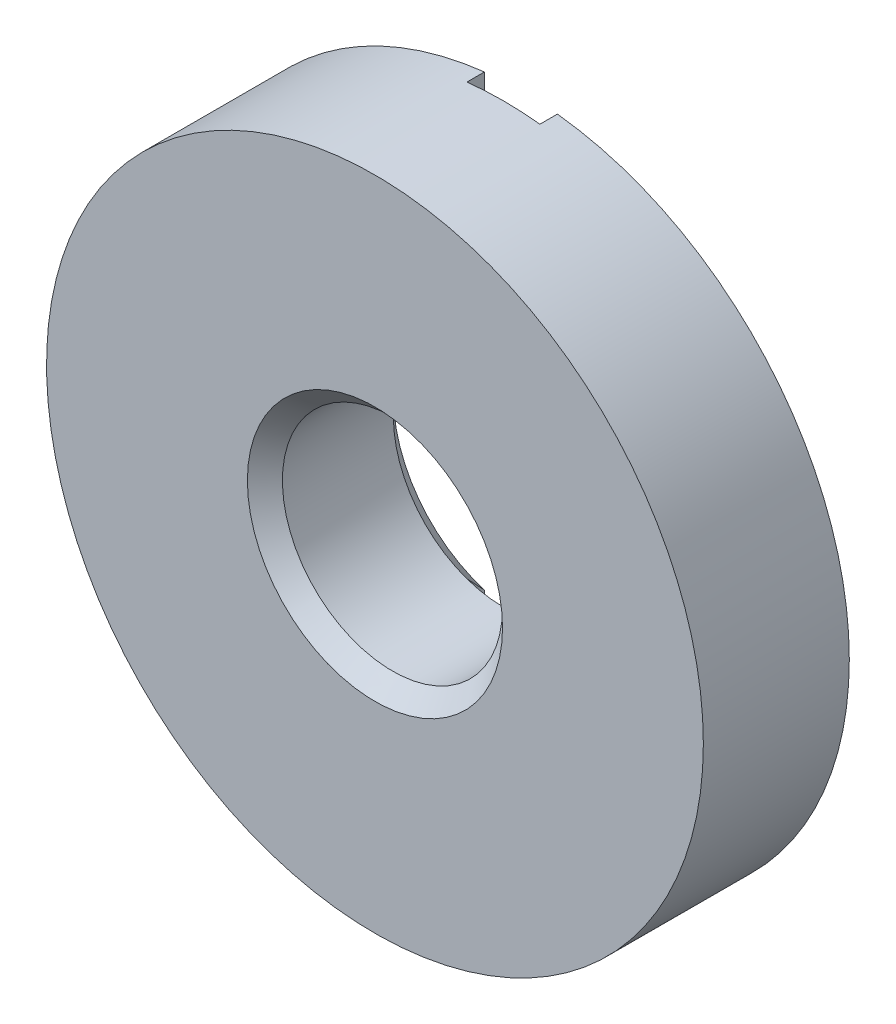
ISO-10303-21;
HEADER;
FILE_DESCRIPTION(('STEP AP214'),'2;1');
FILE_NAME('part.step','',(''),(''),'','','');
FILE_SCHEMA(('AUTOMOTIVE_DESIGN { 1 0 10303 214 1 1 1 1 }'));
ENDSEC;
DATA;
#1=APPLICATION_CONTEXT('core data for automotive mechanical design processes');
#2=APPLICATION_PROTOCOL_DEFINITION('international standard','automotive_design',2000,#1);
#3=PRODUCT_CONTEXT('',#1,'mechanical');
#4=PRODUCT('Part','Part','',(#3));
#5=PRODUCT_RELATED_PRODUCT_CATEGORY('part','',(#4));
#6=PRODUCT_DEFINITION_FORMATION('','',#4);
#7=PRODUCT_DEFINITION_CONTEXT('part definition',#1,'design');
#8=PRODUCT_DEFINITION('design','',#6,#7);
#9=PRODUCT_DEFINITION_SHAPE('','',#8);
#10=(LENGTH_UNIT() NAMED_UNIT(*) SI_UNIT(.MILLI.,.METRE.));
#11=(NAMED_UNIT(*) PLANE_ANGLE_UNIT() SI_UNIT($,.RADIAN.));
#12=(NAMED_UNIT(*) SI_UNIT($,.STERADIAN.) SOLID_ANGLE_UNIT());
#13=UNCERTAINTY_MEASURE_WITH_UNIT(LENGTH_MEASURE(1.E-05),#10,'distance_accuracy_value','');
#14=(GEOMETRIC_REPRESENTATION_CONTEXT(3) GLOBAL_UNCERTAINTY_ASSIGNED_CONTEXT((#13)) GLOBAL_UNIT_ASSIGNED_CONTEXT((#10,
#11,#12)) REPRESENTATION_CONTEXT('',''));
#15=CARTESIAN_POINT('',(0.,0.,0.));
#16=DIRECTION('',(0.,0.,1.));
#17=DIRECTION('',(1.,0.,0.));
#18=AXIS2_PLACEMENT_3D('',#15,#16,#17);
#19=CARTESIAN_POINT('',(0.,0.,0.));
#20=DIRECTION('',(0.,0.,1.));
#21=DIRECTION('',(1.,0.,0.));
#22=AXIS2_PLACEMENT_3D('',#19,#20,#21);
#23=PLANE('',#22);
#24=CARTESIAN_POINT('',(0.,0.,0.));
#25=DIRECTION('',(0.,0.,1.));
#26=DIRECTION('',(1.,0.,0.));
#27=AXIS2_PLACEMENT_3D('',#24,#25,#26);
#28=CIRCLE('',#27,14.2875);
#29=CARTESIAN_POINT('',(1.58750000000001,-14.1990316571237,0.));
#30=VERTEX_POINT('',#29);
#31=CARTESIAN_POINT('',(1.58749999999999,14.1990316571237,0.));
#32=VERTEX_POINT('',#31);
#33=EDGE_CURVE('E113',#30,#32,#28,.T.);
#34=ORIENTED_EDGE('',*,*,#33,.F.);
#35=DIRECTION('',(0.,-1.,0.));
#36=VECTOR('',#35,1.);
#37=CARTESIAN_POINT('',(1.5875,14.2875,0.));
#38=LINE('',#37,#36);
#39=CARTESIAN_POINT('',(1.58749999999999,-5.31801031965903,0.));
#40=VERTEX_POINT('',#39);
#41=EDGE_CURVE('E117',#40,#30,#38,.T.);
#42=ORIENTED_EDGE('',*,*,#41,.F.);
#43=CARTESIAN_POINT('',(0.,0.,0.));
#44=DIRECTION('',(0.,0.,1.));
#45=DIRECTION('',(1.,0.,0.));
#46=AXIS2_PLACEMENT_3D('',#43,#44,#45);
#47=CIRCLE('',#46,5.5499);
#48=CARTESIAN_POINT('',(1.5875,5.31801031965903,0.));
#49=VERTEX_POINT('',#48);
#50=EDGE_CURVE('E115',#40,#49,#47,.T.);
#51=ORIENTED_EDGE('',*,*,#50,.T.);
#52=EDGE_CURVE('E101',#32,#49,#38,.T.);
#53=ORIENTED_EDGE('',*,*,#52,.F.);
#54=EDGE_LOOP('',(#34,#42,#51,#53));
#55=FACE_BOUND('',#54,.T.);
#56=ADVANCED_FACE('F30',(#55),#23,.F.);
#57=CARTESIAN_POINT('',(0.,0.,0.));
#58=DIRECTION('',(0.,0.,-1.));
#59=DIRECTION('',(-1.,0.,0.));
#60=AXIS2_PLACEMENT_3D('',#57,#58,#59);
#61=CONICAL_SURFACE('',#60,5.5499,0.785398163397447);
#62=CARTESIAN_POINT('',(1.58749999999998,12.1221484031437,-6.67575491733832));
#63=CARTESIAN_POINT('',(1.58749999999999,11.7570954681044,-6.31380799407897));
#64=CARTESIAN_POINT('',(1.58749999999999,11.3919190420632,-5.9519853542707));
#65=CARTESIAN_POINT('',(1.5875,10.6610798175729,-5.22859578225957));
#66=CARTESIAN_POINT('',(1.5875,10.2954169002337,-4.86702897018464));
#67=CARTESIAN_POINT('',(1.58749999999999,9.56129290110102,-4.1421130516113));
#68=CARTESIAN_POINT('',(1.58749999999999,9.19282871654997,-3.77876708642412));
#69=CARTESIAN_POINT('',(1.58749999999999,8.45531591488684,-3.05290340228056));
#70=CARTESIAN_POINT('',(1.58749999999999,8.08626752122839,-2.69038545643448));
#71=CARTESIAN_POINT('',(1.58749999999999,7.47379209930674,-2.09047605632119));
#72=CARTESIAN_POINT('',(1.58749999999999,7.23066076030103,-1.85278280617774));
#73=CARTESIAN_POINT('',(1.58749999999999,6.74378682364067,-1.37800721222766));
#74=CARTESIAN_POINT('',(1.58749999999999,6.50004420658945,-1.14092488830303));
#75=CARTESIAN_POINT('',(1.58749999999999,6.01146771393436,-0.667356127307738));
#76=CARTESIAN_POINT('',(1.58749999999999,5.76663294237815,-0.43087061365841));
#77=CARTESIAN_POINT('',(1.58749999999999,5.27580945145356,0.0408421111267584));
#78=CARTESIAN_POINT('',(1.58749999999999,5.02982087278743,0.276069468567781));
#79=CARTESIAN_POINT('',(1.58749999999999,4.5372811498841,0.743548651866328));
#80=CARTESIAN_POINT('',(1.58749999999999,4.29073846930983,0.975809363817057));
#81=CARTESIAN_POINT('',(1.58749999999999,3.91878163190833,1.32201804911249));
#82=CARTESIAN_POINT('',(1.58749999999999,3.79440911684733,1.43708425836197));
#83=CARTESIAN_POINT('',(1.58749999999999,3.54475450969965,1.6662197754174));
#84=CARTESIAN_POINT('',(1.58749999999999,3.41947244400727,1.78028911194163));
#85=CARTESIAN_POINT('',(1.58749999999999,3.16795070070268,2.0068664486026));
#86=CARTESIAN_POINT('',(1.58749999999999,3.04171341364745,2.1193770955283));
#87=CARTESIAN_POINT('',(1.58749999999999,2.78760570257134,2.34253270077562));
#88=CARTESIAN_POINT('',(1.58749999999999,2.65973534045426,2.45317772944916));
#89=CARTESIAN_POINT('',(1.58749999999999,2.40179255892945,2.67170053620932));
#90=CARTESIAN_POINT('',(1.58749999999999,2.27172181890931,2.77958027950918));
#91=CARTESIAN_POINT('',(1.58749999999998,2.07412203055608,2.93826839323586));
#92=CARTESIAN_POINT('',(1.58749999999998,2.00784707888308,2.99063705366885));
#93=CARTESIAN_POINT('',(1.58749999999999,1.87426755752694,3.0940419058224));
#94=CARTESIAN_POINT('',(1.58749999999999,1.80696305457937,3.14507818333251));
#95=CARTESIAN_POINT('',(1.58749999999999,1.69830578866812,3.22532509459955));
#96=CARTESIAN_POINT('',(1.58749999999999,1.65736023361424,3.25508710889305));
#97=CARTESIAN_POINT('',(1.58749999999998,1.57494424359068,3.31388325175616));
#98=CARTESIAN_POINT('',(1.58749999999998,1.53347377016124,3.34291732652101));
#99=CARTESIAN_POINT('',(1.58749999999999,1.4499184595479,3.40013455186738));
#100=CARTESIAN_POINT('',(1.58749999999998,1.40783333574583,3.42831728536005));
#101=CARTESIAN_POINT('',(1.58749999999998,1.32298635939272,3.48364303217288));
#102=CARTESIAN_POINT('',(1.58749999999999,1.28022451410843,3.51078605664695));
#103=CARTESIAN_POINT('',(1.58749999999998,1.15158098932279,3.58986874897836));
#104=CARTESIAN_POINT('',(1.58749999999998,1.06456962658402,3.63999959669667));
#105=CARTESIAN_POINT('',(1.58749999999999,0.886780389410811,3.73308712320396));
#106=CARTESIAN_POINT('',(1.5875,0.796006411731415,3.7760510036147));
#107=CARTESIAN_POINT('',(1.5875,0.655256941691239,3.83303736396336));
#108=CARTESIAN_POINT('',(1.58749999999999,0.606873963125737,3.85098283541978));
#109=CARTESIAN_POINT('',(1.58749999999998,0.508962671131523,3.88344699267299));
#110=CARTESIAN_POINT('',(1.58749999999998,0.45943451197046,3.89796613711235));
#111=CARTESIAN_POINT('',(1.58749999999998,0.359562194353989,3.92290407714523));
#112=CARTESIAN_POINT('',(1.58749999999998,0.309222312618565,3.93333976002365));
#113=CARTESIAN_POINT('',(1.58749999999999,0.207810526081183,3.94963759108361));
#114=CARTESIAN_POINT('',(1.5875,0.156738848333999,3.95550112786206));
#115=CARTESIAN_POINT('',(1.5875,0.0537774041918381,3.96232748772384));
#116=CARTESIAN_POINT('',(1.58749999999999,0.00188446746999056,3.96324348284987));
#117=CARTESIAN_POINT('',(1.58749999999998,-0.101737902321828,3.95998671492023));
#118=CARTESIAN_POINT('',(1.58749999999998,-0.153467335551964,3.95581395685097));
#119=CARTESIAN_POINT('',(1.58749999999998,-0.256450834954672,3.94263353657915));
#120=CARTESIAN_POINT('',(1.58749999999998,-0.307703052731211,3.93361167307319));
#121=CARTESIAN_POINT('',(1.58749999999999,-0.409249338563541,3.91124658708039));
#122=CARTESIAN_POINT('',(1.5875,-0.459543187450374,3.89790238838602));
#123=CARTESIAN_POINT('',(1.5875,-0.584600799973045,3.85970293576747));
#124=CARTESIAN_POINT('',(1.58749999999999,-0.658632072336069,3.83245832063773));
#125=CARTESIAN_POINT('',(1.58749999999998,-0.804029822206075,3.77162933532428));
#126=CARTESIAN_POINT('',(1.58749999999998,-0.875394183498946,3.7380400533935));
#127=CARTESIAN_POINT('',(1.58749999999998,-1.01606572690302,3.66605358449684));
#128=CARTESIAN_POINT('',(1.58749999999999,-1.08536122989489,3.62763383159612));
#129=CARTESIAN_POINT('',(1.58749999999998,-1.18775332639388,3.56743780194912));
#130=CARTESIAN_POINT('',(1.58749999999998,-1.22161995594776,3.54694837219459));
#131=CARTESIAN_POINT('',(1.58749999999999,-1.28888991915516,3.5052245658829));
#132=CARTESIAN_POINT('',(1.58749999999999,-1.32229327179467,3.48399021998048));
#133=CARTESIAN_POINT('',(1.58750000000001,-1.43416568784318,3.41135008528609));
#134=CARTESIAN_POINT('',(1.58749999999999,-1.51167593948648,3.3584666252009));
#135=CARTESIAN_POINT('',(1.58749999999997,-1.66487202068265,3.25011060759266));
#136=CARTESIAN_POINT('',(1.58749999999998,-1.74055742534233,3.19463745575352));
#137=CARTESIAN_POINT('',(1.58749999999998,-1.89053447623017,3.08173498737855));
#138=CARTESIAN_POINT('',(1.58749999999998,-1.96482509246081,3.02430430708381));
#139=CARTESIAN_POINT('',(1.58749999999998,-2.11225519214408,2.90798094715248));
#140=CARTESIAN_POINT('',(1.58749999999998,-2.185394606976,2.84908818089921));
#141=CARTESIAN_POINT('',(1.58749999999998,-2.40378999414472,2.67044102364431));
#142=CARTESIAN_POINT('',(1.58749999999998,-2.5476609933311,2.54899578438282));
#143=CARTESIAN_POINT('',(1.58749999999998,-2.83288762934164,2.30333045155473));
#144=CARTESIAN_POINT('',(1.58749999999998,-2.97424429358795,2.17911154046385));
#145=CARTESIAN_POINT('',(1.58749999999998,-3.25574661829427,1.92830605366546));
#146=CARTESIAN_POINT('',(1.58749999999998,-3.39588613796264,1.8017125979391));
#147=CARTESIAN_POINT('',(1.58749999999998,-3.67493060334792,1.54714717567381));
#148=CARTESIAN_POINT('',(1.58749999999998,-3.81383542040228,1.41917506847556));
#149=CARTESIAN_POINT('',(1.58749999999998,-4.22874477507404,1.03418280588988));
#150=CARTESIAN_POINT('',(1.5875,-4.50338261976182,0.775691371231971));
#151=CARTESIAN_POINT('',(1.58750000000001,-5.09043747387443,0.218571463569759));
#152=CARTESIAN_POINT('',(1.58749999999999,-5.40251874564525,-0.0804092504348554));
#153=CARTESIAN_POINT('',(1.58749999999997,-6.0249734524618,-0.680153431008247));
#154=CARTESIAN_POINT('',(1.58749999999998,-6.33534685322798,-0.980916933110402));
#155=CARTESIAN_POINT('',(1.58749999999998,-6.95518110373081,-1.58379031763081));
#156=CARTESIAN_POINT('',(1.58749999999998,-7.26464121516097,-1.88590095823905));
#157=CARTESIAN_POINT('',(1.58749999999998,-7.88279082009666,-2.49090468584607));
#158=CARTESIAN_POINT('',(1.58749999999998,-8.19148031920897,-2.79379776711921));
#159=CARTESIAN_POINT('',(1.58749999999997,-8.80261283619911,-3.39454342249577));
#160=CARTESIAN_POINT('',(1.58749999999997,-9.10506591787301,-3.6923857630458));
#161=CARTESIAN_POINT('',(1.58749999999997,-9.70957838736377,-4.28847107398571));
#162=CARTESIAN_POINT('',(1.58749999999997,-10.0116377742284,-4.5867140453411));
#163=CARTESIAN_POINT('',(1.58749999999997,-10.6152394460542,-5.18328923282719));
#164=CARTESIAN_POINT('',(1.58749999999997,-10.9167819466185,-5.48162123086237));
#165=CARTESIAN_POINT('',(1.58749999999997,-11.5196283561626,-6.07852431793235));
#166=CARTESIAN_POINT('',(1.58749999999998,-11.8209322658885,-6.37709540621349));
#167=CARTESIAN_POINT('',(1.5875,-12.1221484031436,-6.67575491733832));
#168=B_SPLINE_CURVE_WITH_KNOTS('',3,(#62,#63,#64,#65,#66,#67,#68,#69,#70,#71,#72,#73,#74,#75,
#76,#77,#78,#79,#80,#81,#82,#83,#84,#85,#86,#87,#88,#89,#90,#91,#92,#93,#94,#95,#96,#97,#98,#99,
#100,#101,#102,#103,#104,#105,#106,#107,#108,#109,#110,#111,#112,#113,#114,#115,#116,#117,#118,
#119,#120,#121,#122,#123,#124,#125,#126,#127,#128,#129,#130,#131,#132,#133,#134,#135,#136,#137,
#138,#139,#140,#141,#142,#143,#144,#145,#146,#147,#148,#149,#150,#151,#152,#153,#154,#155,#156,
#157,#158,#159,#160,#161,#162,#163,#164,#165,#166,#167),.UNSPECIFIED.,.F.,.F.,(4,2,2,2,2,2,2,2,
2,2,2,2,2,2,2,2,2,2,2,2,2,2,2,2,2,2,2,2,2,2,2,2,2,2,2,2,2,2,2,2,2,2,2,2,2,2,2,2,2,2,2,2,4),(0.,
1.54221392456978,3.08492530901473,4.63736643394518,6.18931323143288,7.20936064988247,
8.22944085583609,9.25062581291124,10.2716893202917,11.2878183716827,11.7961241838145,
12.3044153038859,12.8116988435961,13.3189632108135,13.8258564801241,14.0792486490931,
14.3326244621883,14.4844759717963,14.6363386724287,14.7882746051068,14.9402089073751,
15.2412598109357,15.5420063615341,15.696716189855,15.8514052972085,16.0054477453494,
16.1594433913396,16.3148940683148,16.4703445929658,16.6262528774389,16.782196398672,
17.0184240740963,17.254835381166,17.4923952716798,17.611135444849,17.7298707373469,
18.0112838146009,18.2927617947497,18.5744400509826,18.8561350343658,19.420893886969,
19.9854164019303,20.5519583111244,21.1185585807257,22.2499883256386,23.5465351719877,
24.8431079477502,26.1405372695918,27.4379571239996,28.7114131056393,29.9848721617947,
31.2574162191119,32.5299562808498),.UNSPECIFIED.);
#169=CARTESIAN_POINT('',(1.5875,4.51705990219303,0.762000000000013));
#170=VERTEX_POINT('',#169);
#171=EDGE_CURVE('E11',#49,#170,#168,.T.);
#172=ORIENTED_EDGE('',*,*,#171,.F.);
#173=ORIENTED_EDGE('',*,*,#50,.F.);
#174=CARTESIAN_POINT('',(1.58749999999999,-4.51705990219301,0.762000000000013));
#175=VERTEX_POINT('',#174);
#176=EDGE_CURVE('E34',#175,#40,#168,.T.);
#177=ORIENTED_EDGE('',*,*,#176,.F.);
#178=CARTESIAN_POINT('',(0.,0.,0.762000000000013));
#179=DIRECTION('',(0.,0.,1.));
#180=DIRECTION('',(1.,0.,0.));
#181=AXIS2_PLACEMENT_3D('',#178,#179,#180);
#182=CIRCLE('',#181,4.7879);
#183=EDGE_CURVE('E135',#170,#175,#182,.F.);
#184=ORIENTED_EDGE('',*,*,#183,.F.);
#185=EDGE_LOOP('',(#172,#173,#177,#184));
#186=FACE_BOUND('',#185,.T.);
#187=ADVANCED_FACE('F173',(#186),#61,.F.);
#188=CARTESIAN_POINT('',(0.,0.,6.34999999999999));
#189=DIRECTION('',(0.,0.,1.));
#190=DIRECTION('',(1.,0.,0.));
#191=AXIS2_PLACEMENT_3D('',#188,#189,#190);
#192=PLANE('',#191);
#193=CARTESIAN_POINT('',(0.,0.,6.34999999999999));
#194=DIRECTION('',(0.,0.,1.));
#195=DIRECTION('',(1.,0.,0.));
#196=AXIS2_PLACEMENT_3D('',#193,#194,#195);
#197=CIRCLE('',#196,5.5499);
#198=CARTESIAN_POINT('',(5.5499,0.,6.34999999999999));
#199=VERTEX_POINT('',#198);
#200=EDGE_CURVE('E139',#199,#199,#197,.F.);
#201=ORIENTED_EDGE('',*,*,#200,.T.);
#202=EDGE_LOOP('',(#201));
#203=FACE_BOUND('',#202,.T.);
#204=CARTESIAN_POINT('',(0.,0.,6.34999999999999));
#205=DIRECTION('',(0.,0.,1.));
#206=DIRECTION('',(1.,0.,0.));
#207=AXIS2_PLACEMENT_3D('',#204,#205,#206);
#208=CIRCLE('',#207,14.2875);
#209=CARTESIAN_POINT('',(14.2875,0.,6.35));
#210=VERTEX_POINT('',#209);
#211=EDGE_CURVE('E125',#210,#210,#208,.T.);
#212=ORIENTED_EDGE('',*,*,#211,.T.);
#213=EDGE_LOOP('',(#212));
#214=FACE_BOUND('',#213,.T.);
#215=ADVANCED_FACE('F182',(#203,#214),#192,.T.);
#216=CARTESIAN_POINT('',(-1.5875,14.1990316571237,0.));
#217=VERTEX_POINT('',#216);
#218=CARTESIAN_POINT('',(-1.5875,-14.1990316571237,0.));
#219=VERTEX_POINT('',#218);
#220=EDGE_CURVE('E122',#217,#219,#28,.T.);
#221=ORIENTED_EDGE('',*,*,#220,.F.);
#222=DIRECTION('',(0.,1.,0.));
#223=VECTOR('',#222,1.);
#224=CARTESIAN_POINT('',(-1.5875,14.2875,0.));
#225=LINE('',#224,#223);
#226=CARTESIAN_POINT('',(-1.58750000000001,5.31801031965904,0.));
#227=VERTEX_POINT('',#226);
#228=EDGE_CURVE('E116',#227,#217,#225,.T.);
#229=ORIENTED_EDGE('',*,*,#228,.F.);
#230=CARTESIAN_POINT('',(-1.5875,-5.31801031965904,0.));
#231=VERTEX_POINT('',#230);
#232=EDGE_CURVE('E131',#227,#231,#47,.T.);
#233=ORIENTED_EDGE('',*,*,#232,.T.);
#234=EDGE_CURVE('E196',#219,#231,#225,.T.);
#235=ORIENTED_EDGE('',*,*,#234,.F.);
#236=EDGE_LOOP('',(#221,#229,#233,#235));
#237=FACE_BOUND('',#236,.T.);
#238=ADVANCED_FACE('F178',(#237),#23,.F.);
#239=CARTESIAN_POINT('',(0.,0.,6.34999999999999));
#240=DIRECTION('',(0.,0.,-1.));
#241=DIRECTION('',(-1.,0.,0.));
#242=AXIS2_PLACEMENT_3D('',#239,#240,#241);
#243=CYLINDRICAL_SURFACE('',#242,14.2875);
#244=ORIENTED_EDGE('',*,*,#33,.T.);
#245=DIRECTION('',(0.,0.,-1.));
#246=VECTOR('',#245,1.);
#247=CARTESIAN_POINT('',(1.58749999999999,14.1990316571237,6.34999999999999));
#248=LINE('',#247,#246);
#249=CARTESIAN_POINT('',(1.58749999999999,14.1990316571237,0.762000000000013));
#250=VERTEX_POINT('',#249);
#251=EDGE_CURVE('E98',#32,#250,#248,.F.);
#252=ORIENTED_EDGE('',*,*,#251,.T.);
#253=CARTESIAN_POINT('',(0.,0.,0.762000000000013));
#254=DIRECTION('',(0.,0.,-1.));
#255=DIRECTION('',(-1.,0.,0.));
#256=AXIS2_PLACEMENT_3D('',#253,#254,#255);
#257=CIRCLE('',#256,14.2875);
#258=CARTESIAN_POINT('',(-1.5875,14.1990316571237,0.762000000000013));
#259=VERTEX_POINT('',#258);
#260=EDGE_CURVE('E200',#259,#250,#257,.T.);
#261=ORIENTED_EDGE('',*,*,#260,.F.);
#262=DIRECTION('',(0.,0.,-1.));
#263=VECTOR('',#262,1.);
#264=CARTESIAN_POINT('',(-1.58749999999998,14.1990316571237,6.34999999999999));
#265=LINE('',#264,#263);
#266=EDGE_CURVE('E107',#259,#217,#265,.T.);
#267=ORIENTED_EDGE('',*,*,#266,.T.);
#268=ORIENTED_EDGE('',*,*,#220,.T.);
#269=DIRECTION('',(0.,0.,-1.));
#270=VECTOR('',#269,1.);
#271=CARTESIAN_POINT('',(-1.5875,-14.1990316571237,6.34999999999999));
#272=LINE('',#271,#270);
#273=CARTESIAN_POINT('',(-1.5875,-14.1990316571237,0.762000000000013));
#274=VERTEX_POINT('',#273);
#275=EDGE_CURVE('E199',#219,#274,#272,.F.);
#276=ORIENTED_EDGE('',*,*,#275,.T.);
#277=CARTESIAN_POINT('',(1.58750000000001,-14.1990316571237,0.762000000000013));
#278=VERTEX_POINT('',#277);
#279=EDGE_CURVE('E207',#278,#274,#257,.T.);
#280=ORIENTED_EDGE('',*,*,#279,.F.);
#281=DIRECTION('',(0.,0.,-1.));
#282=VECTOR('',#281,1.);
#283=CARTESIAN_POINT('',(1.58750000000001,-14.1990316571237,6.34999999999999));
#284=LINE('',#283,#282);
#285=EDGE_CURVE('E106',#278,#30,#284,.T.);
#286=ORIENTED_EDGE('',*,*,#285,.T.);
#287=EDGE_LOOP('',(#244,#252,#261,#267,#268,#276,#280,#286));
#288=FACE_BOUND('',#287,.T.);
#289=ORIENTED_EDGE('',*,*,#211,.F.);
#290=EDGE_LOOP('',(#289));
#291=FACE_BOUND('',#290,.T.);
#292=ADVANCED_FACE('F32',(#288,#291),#243,.T.);
#293=CARTESIAN_POINT('',(0.,0.,6.34999999999999));
#294=DIRECTION('',(0.,0.,-1.));
#295=DIRECTION('',(-1.,0.,0.));
#296=AXIS2_PLACEMENT_3D('',#293,#294,#295);
#297=CYLINDRICAL_SURFACE('',#296,4.7879);
#298=CARTESIAN_POINT('',(-1.58749999999998,-4.51705990219302,0.762000000000013));
#299=VERTEX_POINT('',#298);
#300=EDGE_CURVE('E136',#175,#299,#182,.F.);
#301=ORIENTED_EDGE('',*,*,#300,.T.);
#302=CARTESIAN_POINT('',(-1.5875,4.51705990219303,0.762000000000013));
#303=VERTEX_POINT('',#302);
#304=EDGE_CURVE('E140',#299,#303,#182,.F.);
#305=ORIENTED_EDGE('',*,*,#304,.T.);
#306=EDGE_CURVE('E219',#303,#170,#182,.F.);
#307=ORIENTED_EDGE('',*,*,#306,.T.);
#308=ORIENTED_EDGE('',*,*,#183,.T.);
#309=EDGE_LOOP('',(#301,#305,#307,#308));
#310=FACE_BOUND('',#309,.T.);
#311=CARTESIAN_POINT('',(0.,0.,5.58800000000001));
#312=DIRECTION('',(0.,0.,1.));
#313=DIRECTION('',(1.,0.,0.));
#314=AXIS2_PLACEMENT_3D('',#311,#312,#313);
#315=CIRCLE('',#314,4.7879);
#316=CARTESIAN_POINT('',(4.7879,0.,5.58800000000001));
#317=VERTEX_POINT('',#316);
#318=EDGE_CURVE('E132',#317,#317,#315,.T.);
#319=ORIENTED_EDGE('',*,*,#318,.T.);
#320=EDGE_LOOP('',(#319));
#321=FACE_BOUND('',#320,.T.);
#322=ADVANCED_FACE('F171',(#310,#321),#297,.F.);
#323=CARTESIAN_POINT('',(-1.58749999999998,-12.1221484031437,-6.67575491733832));
#324=CARTESIAN_POINT('',(-1.58750000000001,-11.7570954681044,-6.31380799407896));
#325=CARTESIAN_POINT('',(-1.58750000000001,-11.3919190420632,-5.95198535427069));
#326=CARTESIAN_POINT('',(-1.58750000000002,-10.6610798175729,-5.22859578225955));
#327=CARTESIAN_POINT('',(-1.58750000000002,-10.2954169002337,-4.86702897018461));
#328=CARTESIAN_POINT('',(-1.58750000000001,-9.56129290110097,-4.14211305161126));
#329=CARTESIAN_POINT('',(-1.58750000000002,-9.19282871654991,-3.77876708642406));
#330=CARTESIAN_POINT('',(-1.58750000000002,-8.45531591488676,-3.05290340228049));
#331=CARTESIAN_POINT('',(-1.58750000000001,-8.08626752122829,-2.69038545643439));
#332=CARTESIAN_POINT('',(-1.58750000000001,-7.47379209930664,-2.0904760563211));
#333=CARTESIAN_POINT('',(-1.58750000000001,-7.23066076030094,-1.85278280617766));
#334=CARTESIAN_POINT('',(-1.58750000000001,-6.74378682364058,-1.37800721222758));
#335=CARTESIAN_POINT('',(-1.58750000000001,-6.50004420658937,-1.14092488830296));
#336=CARTESIAN_POINT('',(-1.58750000000001,-6.01146771393428,-0.66735612730767));
#337=CARTESIAN_POINT('',(-1.58750000000001,-5.76663294237807,-0.430870613658344));
#338=CARTESIAN_POINT('',(-1.58750000000001,-5.27580945145349,0.0408421111268177));
#339=CARTESIAN_POINT('',(-1.58750000000001,-5.02982087278736,0.276069468567836));
#340=CARTESIAN_POINT('',(-1.58750000000001,-4.53728114988404,0.743548651866375));
#341=CARTESIAN_POINT('',(-1.58750000000001,-4.29073846930977,0.975809363817099));
#342=CARTESIAN_POINT('',(-1.58750000000001,-3.91878163190828,1.32201804911252));
#343=CARTESIAN_POINT('',(-1.58750000000001,-3.79440911684729,1.43708425836201));
#344=CARTESIAN_POINT('',(-1.58750000000001,-3.54475450969961,1.66621977541743));
#345=CARTESIAN_POINT('',(-1.58750000000001,-3.41947244400723,1.78028911194166));
#346=CARTESIAN_POINT('',(-1.58750000000001,-3.16795070070264,2.00686644860263));
#347=CARTESIAN_POINT('',(-1.58750000000001,-3.04171341364742,2.11937709552832));
#348=CARTESIAN_POINT('',(-1.58750000000001,-2.78760570257131,2.34253270077563));
#349=CARTESIAN_POINT('',(-1.58750000000001,-2.65973534045424,2.45317772944917));
#350=CARTESIAN_POINT('',(-1.58750000000001,-2.40179255892944,2.67170053620932));
#351=CARTESIAN_POINT('',(-1.58750000000001,-2.2717218189093,2.77958027950918));
#352=CARTESIAN_POINT('',(-1.58750000000001,-2.07412203055607,2.93826839323585));
#353=CARTESIAN_POINT('',(-1.58750000000002,-2.00784707888306,2.99063705366884));
#354=CARTESIAN_POINT('',(-1.5875,-1.87426755752694,3.09404190582239));
#355=CARTESIAN_POINT('',(-1.58749999999999,-1.80696305457939,3.14507818333252));
#356=CARTESIAN_POINT('',(-1.58749999999999,-1.69830578866813,3.22532509459955));
#357=CARTESIAN_POINT('',(-1.58750000000001,-1.65736023361424,3.25508710889303));
#358=CARTESIAN_POINT('',(-1.58750000000001,-1.57494424359068,3.31388325175614));
#359=CARTESIAN_POINT('',(-1.58750000000001,-1.53347377016123,3.342917326521));
#360=CARTESIAN_POINT('',(-1.58750000000001,-1.4499184595479,3.40013455186737));
#361=CARTESIAN_POINT('',(-1.58750000000001,-1.40783333574582,3.42831728536003));
#362=CARTESIAN_POINT('',(-1.58750000000001,-1.32298635939271,3.48364303217287));
#363=CARTESIAN_POINT('',(-1.58750000000001,-1.28022451410842,3.51078605664693));
#364=CARTESIAN_POINT('',(-1.58750000000001,-1.15158098932278,3.58986874897835));
#365=CARTESIAN_POINT('',(-1.58750000000001,-1.064569626584,3.63999959669666));
#366=CARTESIAN_POINT('',(-1.58750000000001,-0.886780389410788,3.73308712320395));
#367=CARTESIAN_POINT('',(-1.5875,-0.796006411731394,3.77605100361471));
#368=CARTESIAN_POINT('',(-1.58750000000001,-0.655256941691213,3.83303736396336));
#369=CARTESIAN_POINT('',(-1.58750000000001,-0.60687396312571,3.85098283541976));
#370=CARTESIAN_POINT('',(-1.58750000000001,-0.508962671131497,3.88344699267297));
#371=CARTESIAN_POINT('',(-1.58750000000001,-0.459434511970436,3.89796613711233));
#372=CARTESIAN_POINT('',(-1.58750000000001,-0.359562194353969,3.92290407714521));
#373=CARTESIAN_POINT('',(-1.58750000000001,-0.309222312618546,3.93333976002362));
#374=CARTESIAN_POINT('',(-1.58750000000001,-0.20781052608117,3.9496375910836));
#375=CARTESIAN_POINT('',(-1.5875,-0.15673884833399,3.95550112786206));
#376=CARTESIAN_POINT('',(-1.5875,-0.0537774041918341,3.96232748772384));
#377=CARTESIAN_POINT('',(-1.58750000000001,-0.00188446746998674,3.96324348284985));
#378=CARTESIAN_POINT('',(-1.58750000000001,0.101737902321832,3.9599867149202));
#379=CARTESIAN_POINT('',(-1.58750000000001,0.153467335551969,3.95581395685094));
#380=CARTESIAN_POINT('',(-1.58750000000001,0.256450834954677,3.94263353657913));
#381=CARTESIAN_POINT('',(-1.58750000000001,0.307703052731215,3.93361167307316));
#382=CARTESIAN_POINT('',(-1.5875,0.409249338563548,3.91124658708037));
#383=CARTESIAN_POINT('',(-1.58749999999999,0.459543187450386,3.89790238838602));
#384=CARTESIAN_POINT('',(-1.58749999999998,0.584600799973057,3.85970293576747));
#385=CARTESIAN_POINT('',(-1.5875,0.658632072336073,3.83245832063772));
#386=CARTESIAN_POINT('',(-1.58750000000001,0.804029822206073,3.77162933532424));
#387=CARTESIAN_POINT('',(-1.58750000000001,0.875394183498947,3.73804005339347));
#388=CARTESIAN_POINT('',(-1.58750000000001,1.01606572690302,3.66605358449682));
#389=CARTESIAN_POINT('',(-1.58750000000001,1.0853612298949,3.6276338315961));
#390=CARTESIAN_POINT('',(-1.58750000000001,1.18775332639388,3.56743780194909));
#391=CARTESIAN_POINT('',(-1.58750000000001,1.22161995594777,3.54694837219456));
#392=CARTESIAN_POINT('',(-1.58750000000001,1.28888991915517,3.50522456588288));
#393=CARTESIAN_POINT('',(-1.5875,1.32229327179468,3.48399021998048));
#394=CARTESIAN_POINT('',(-1.58749999999999,1.43416568784321,3.41135008528611));
#395=CARTESIAN_POINT('',(-1.5875,1.51167593948649,3.35846662520089));
#396=CARTESIAN_POINT('',(-1.58750000000001,1.66487202068265,3.25011060759264));
#397=CARTESIAN_POINT('',(-1.58750000000001,1.74055742534233,3.19463745575351));
#398=CARTESIAN_POINT('',(-1.58750000000001,1.89053447623017,3.08173498737853));
#399=CARTESIAN_POINT('',(-1.58750000000001,1.9648250924608,3.0243043070838));
#400=CARTESIAN_POINT('',(-1.58750000000001,2.11225519214408,2.90798094715247));
#401=CARTESIAN_POINT('',(-1.58750000000001,2.18539460697599,2.8490881808992));
#402=CARTESIAN_POINT('',(-1.58750000000001,2.40378999414472,2.6704410236443));
#403=CARTESIAN_POINT('',(-1.58750000000001,2.5476609933311,2.5489957843828));
#404=CARTESIAN_POINT('',(-1.58750000000001,2.83288762934164,2.30333045155471));
#405=CARTESIAN_POINT('',(-1.58750000000001,2.97424429358795,2.17911154046384));
#406=CARTESIAN_POINT('',(-1.58750000000001,3.25574661829428,1.92830605366544));
#407=CARTESIAN_POINT('',(-1.5875,3.39588613796265,1.80171259793908));
#408=CARTESIAN_POINT('',(-1.5875,3.67493060334793,1.54714717567379));
#409=CARTESIAN_POINT('',(-1.5875,3.81383542040229,1.41917506847554));
#410=CARTESIAN_POINT('',(-1.5875,4.22874477507405,1.03418280588986));
#411=CARTESIAN_POINT('',(-1.5875,4.50338261976183,0.775691371231945));
#412=CARTESIAN_POINT('',(-1.5875,5.09043747387445,0.218571463569732));
#413=CARTESIAN_POINT('',(-1.5875,5.40251874564527,-0.0804092504348775));
#414=CARTESIAN_POINT('',(-1.5875,6.02497345246182,-0.680153431008265));
#415=CARTESIAN_POINT('',(-1.5875,6.33534685322799,-0.980916933110422));
#416=CARTESIAN_POINT('',(-1.5875,6.95518110373083,-1.58379031763083));
#417=CARTESIAN_POINT('',(-1.5875,7.26464121516099,-1.88590095823907));
#418=CARTESIAN_POINT('',(-1.5875,7.88279082009668,-2.49090468584609));
#419=CARTESIAN_POINT('',(-1.5875,8.19148031920899,-2.79379776711923));
#420=CARTESIAN_POINT('',(-1.5875,8.80261283619913,-3.39454342249579));
#421=CARTESIAN_POINT('',(-1.5875,9.10506591787302,-3.69238576304582));
#422=CARTESIAN_POINT('',(-1.5875,9.70957838736378,-4.28847107398573));
#423=CARTESIAN_POINT('',(-1.5875,10.0116377742284,-4.58671404534112));
#424=CARTESIAN_POINT('',(-1.5875,10.6152394460542,-5.1832892328272));
#425=CARTESIAN_POINT('',(-1.5875,10.9167819466185,-5.48162123086238));
#426=CARTESIAN_POINT('',(-1.5875,11.5196283561626,-6.07852431793235));
#427=CARTESIAN_POINT('',(-1.5875,11.8209322658885,-6.3770954062135));
#428=CARTESIAN_POINT('',(-1.58750000000001,12.1221484031437,-6.67575491733832));
#429=B_SPLINE_CURVE_WITH_KNOTS('',3,(#323,#324,#325,#326,#327,#328,#329,#330,#331,#332,#333,
#334,#335,#336,#337,#338,#339,#340,#341,#342,#343,#344,#345,#346,#347,#348,#349,#350,#351,#352,
#353,#354,#355,#356,#357,#358,#359,#360,#361,#362,#363,#364,#365,#366,#367,#368,#369,#370,#371,
#372,#373,#374,#375,#376,#377,#378,#379,#380,#381,#382,#383,#384,#385,#386,#387,#388,#389,#390,
#391,#392,#393,#394,#395,#396,#397,#398,#399,#400,#401,#402,#403,#404,#405,#406,#407,#408,#409,
#410,#411,#412,#413,#414,#415,#416,#417,#418,#419,#420,#421,#422,#423,#424,#425,#426,#427,#428),
.UNSPECIFIED.,.F.,.F.,(4,2,2,2,2,2,2,2,2,2,2,2,2,2,2,2,2,2,2,2,2,2,2,2,2,2,2,2,2,2,2,2,2,2,2,2,
2,2,2,2,2,2,2,2,2,2,2,2,2,2,2,2,4),(0.,1.54221392456981,3.08492530901478,4.63736643394528,
6.18931323143301,7.20936064988259,8.22944085583619,9.25062581291133,10.2716893202918,
11.2878183716828,11.7961241838146,12.3044153038859,12.8116988435961,13.3189632108136,
13.8258564801241,14.0792486490931,14.3326244621883,14.4844759717963,14.6363386724287,
14.7882746051068,14.9402089073751,15.2412598109357,15.5420063615341,15.6967161898551,
15.8514052972085,16.0054477453494,16.1594433913396,16.3148940683148,16.4703445929658,
16.6262528774389,16.782196398672,17.0184240740963,17.254835381166,17.4923952716798,
17.611135444849,17.7298707373469,18.0112838146009,18.2927617947497,18.5744400509826,
18.8561350343657,19.420893886969,19.9854164019303,20.5519583111244,21.1185585807257,
22.2499883256386,23.5465351719877,24.8431079477502,26.1405372695918,27.4379571239996,
28.7114131056393,29.9848721617947,31.2574162191119,32.5299562808498),.UNSPECIFIED.);
#430=EDGE_CURVE('E147',#231,#299,#429,.T.);
#431=ORIENTED_EDGE('',*,*,#430,.F.);
#432=ORIENTED_EDGE('',*,*,#232,.F.);
#433=EDGE_CURVE('E142',#303,#227,#429,.T.);
#434=ORIENTED_EDGE('',*,*,#433,.F.);
#435=ORIENTED_EDGE('',*,*,#304,.F.);
#436=EDGE_LOOP('',(#431,#432,#434,#435));
#437=FACE_BOUND('',#436,.T.);
#438=ADVANCED_FACE('F148',(#437),#61,.F.);
#439=CARTESIAN_POINT('',(0.,0.,5.58800000000001));
#440=DIRECTION('',(0.,0.,1.));
#441=DIRECTION('',(1.,0.,0.));
#442=AXIS2_PLACEMENT_3D('',#439,#440,#441);
#443=CONICAL_SURFACE('',#442,4.7879,0.78539816339745);
#444=ORIENTED_EDGE('',*,*,#200,.F.);
#445=EDGE_LOOP('',(#444));
#446=FACE_BOUND('',#445,.T.);
#447=ORIENTED_EDGE('',*,*,#318,.F.);
#448=EDGE_LOOP('',(#447));
#449=FACE_BOUND('',#448,.T.);
#450=ADVANCED_FACE('F163',(#446,#449),#443,.F.);
#451=CARTESIAN_POINT('',(1.5875,14.2875,0.762000000000013));
#452=DIRECTION('',(0.,0.,-1.));
#453=DIRECTION('',(-1.,0.,0.));
#454=AXIS2_PLACEMENT_3D('',#451,#452,#453);
#455=PLANE('',#454);
#456=ORIENTED_EDGE('',*,*,#279,.T.);
#457=DIRECTION('',(0.,1.,0.));
#458=VECTOR('',#457,1.);
#459=CARTESIAN_POINT('',(-1.5875,14.2875,0.762000000000013));
#460=LINE('',#459,#458);
#461=EDGE_CURVE('E57',#274,#299,#460,.T.);
#462=ORIENTED_EDGE('',*,*,#461,.T.);
#463=ORIENTED_EDGE('',*,*,#300,.F.);
#464=DIRECTION('',(0.,-1.,0.));
#465=VECTOR('',#464,1.);
#466=CARTESIAN_POINT('',(1.5875,14.2875,0.762000000000013));
#467=LINE('',#466,#465);
#468=EDGE_CURVE('E210',#175,#278,#467,.T.);
#469=ORIENTED_EDGE('',*,*,#468,.T.);
#470=EDGE_LOOP('',(#456,#462,#463,#469));
#471=FACE_BOUND('',#470,.T.);
#472=ADVANCED_FACE('F165',(#471),#455,.T.);
#473=CARTESIAN_POINT('',(-1.5875,14.2875,0.762000000000013));
#474=DIRECTION('',(-1.,0.,0.));
#475=DIRECTION('',(0.,-1.,0.));
#476=AXIS2_PLACEMENT_3D('',#473,#474,#475);
#477=PLANE('',#476);
#478=ORIENTED_EDGE('',*,*,#234,.T.);
#479=ORIENTED_EDGE('',*,*,#430,.T.);
#480=ORIENTED_EDGE('',*,*,#461,.F.);
#481=ORIENTED_EDGE('',*,*,#275,.F.);
#482=EDGE_LOOP('',(#478,#479,#480,#481));
#483=FACE_BOUND('',#482,.T.);
#484=ADVANCED_FACE('F158',(#483),#477,.F.);
#485=CARTESIAN_POINT('',(1.5875,14.2875,0.762000000000013));
#486=DIRECTION('',(1.,0.,0.));
#487=DIRECTION('',(0.,1.,0.));
#488=AXIS2_PLACEMENT_3D('',#485,#486,#487);
#489=PLANE('',#488);
#490=ORIENTED_EDGE('',*,*,#468,.F.);
#491=ORIENTED_EDGE('',*,*,#176,.T.);
#492=ORIENTED_EDGE('',*,*,#41,.T.);
#493=ORIENTED_EDGE('',*,*,#285,.F.);
#494=EDGE_LOOP('',(#490,#491,#492,#493));
#495=FACE_BOUND('',#494,.T.);
#496=ADVANCED_FACE('F159',(#495),#489,.F.);
#497=ORIENTED_EDGE('',*,*,#52,.T.);
#498=ORIENTED_EDGE('',*,*,#171,.T.);
#499=EDGE_CURVE('E50',#250,#170,#467,.T.);
#500=ORIENTED_EDGE('',*,*,#499,.F.);
#501=ORIENTED_EDGE('',*,*,#251,.F.);
#502=EDGE_LOOP('',(#497,#498,#500,#501));
#503=FACE_BOUND('',#502,.T.);
#504=ADVANCED_FACE('F100',(#503),#489,.F.);
#505=EDGE_CURVE('E208',#303,#259,#460,.T.);
#506=ORIENTED_EDGE('',*,*,#505,.F.);
#507=ORIENTED_EDGE('',*,*,#433,.T.);
#508=ORIENTED_EDGE('',*,*,#228,.T.);
#509=ORIENTED_EDGE('',*,*,#266,.F.);
#510=EDGE_LOOP('',(#506,#507,#508,#509));
#511=FACE_BOUND('',#510,.T.);
#512=ADVANCED_FACE('F152',(#511),#477,.F.);
#513=ORIENTED_EDGE('',*,*,#260,.T.);
#514=ORIENTED_EDGE('',*,*,#499,.T.);
#515=ORIENTED_EDGE('',*,*,#306,.F.);
#516=ORIENTED_EDGE('',*,*,#505,.T.);
#517=EDGE_LOOP('',(#513,#514,#515,#516));
#518=FACE_BOUND('',#517,.T.);
#519=ADVANCED_FACE('F156',(#518),#455,.T.);
#520=CLOSED_SHELL('',(#56,#187,#215,#238,#292,#322,#438,#450,#472,#484,#496,#504,#512,#519));
#521=MANIFOLD_SOLID_BREP('B2',#520);
#522=ADVANCED_BREP_SHAPE_REPRESENTATION('',(#18,#521),#14);
#523=SHAPE_DEFINITION_REPRESENTATION(#9,#522);
ENDSEC;
END-ISO-10303-21;
